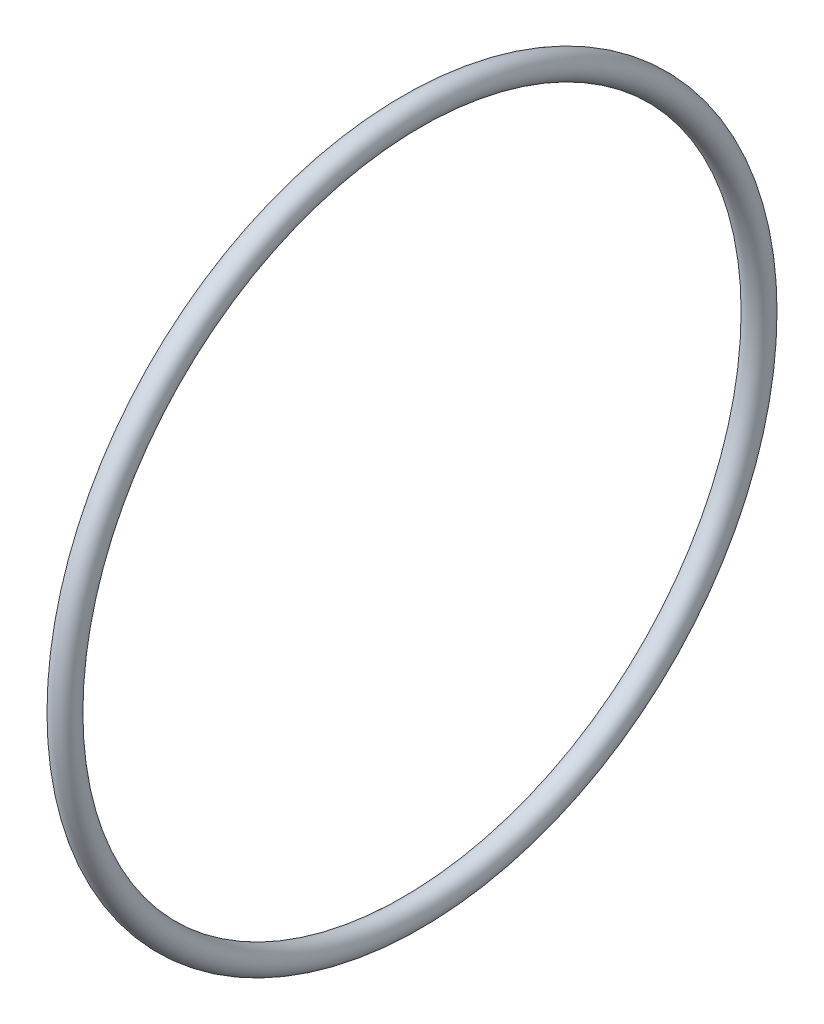
ISO-10303-21;
HEADER;
FILE_DESCRIPTION(('STEP AP214'),'2;1');
FILE_NAME('part.step','',(''),(''),'','','');
FILE_SCHEMA(('AUTOMOTIVE_DESIGN { 1 0 10303 214 1 1 1 1 }'));
ENDSEC;
DATA;
#1=APPLICATION_CONTEXT('core data for automotive mechanical design processes');
#2=APPLICATION_PROTOCOL_DEFINITION('international standard','automotive_design',2000,#1);
#3=PRODUCT_CONTEXT('',#1,'mechanical');
#4=PRODUCT('Part','Part','',(#3));
#5=PRODUCT_RELATED_PRODUCT_CATEGORY('part','',(#4));
#6=PRODUCT_DEFINITION_FORMATION('','',#4);
#7=PRODUCT_DEFINITION_CONTEXT('part definition',#1,'design');
#8=PRODUCT_DEFINITION('design','',#6,#7);
#9=PRODUCT_DEFINITION_SHAPE('','',#8);
#10=(LENGTH_UNIT() NAMED_UNIT(*) SI_UNIT(.MILLI.,.METRE.));
#11=(NAMED_UNIT(*) PLANE_ANGLE_UNIT() SI_UNIT($,.RADIAN.));
#12=(NAMED_UNIT(*) SI_UNIT($,.STERADIAN.) SOLID_ANGLE_UNIT());
#13=UNCERTAINTY_MEASURE_WITH_UNIT(LENGTH_MEASURE(1.E-05),#10,'distance_accuracy_value','');
#14=(GEOMETRIC_REPRESENTATION_CONTEXT(3) GLOBAL_UNCERTAINTY_ASSIGNED_CONTEXT((#13)) GLOBAL_UNIT_ASSIGNED_CONTEXT((#10,
#11,#12)) REPRESENTATION_CONTEXT('',''));
#15=CARTESIAN_POINT('',(0.,0.,0.));
#16=DIRECTION('',(0.,0.,1.));
#17=DIRECTION('',(1.,0.,0.));
#18=AXIS2_PLACEMENT_3D('',#15,#16,#17);
#19=CARTESIAN_POINT('',(26.889800043,0.,0.));
#20=DIRECTION('',(-1.,0.,0.));
#21=DIRECTION('',(0.,0.,1.));
#22=AXIS2_PLACEMENT_3D('',#19,#20,#21);
#23=TOROIDAL_SURFACE('',#22,25.950000043,0.950000004999999);
#24=CARTESIAN_POINT('',(26.889800043,0.,26.900000048));
#25=VERTEX_POINT('',#24);
#26=VERTEX_LOOP('',#25);
#27=FACE_BOUND('',#26,.T.);
#28=ADVANCED_FACE('F33',(#27),#23,.T.);
#29=CLOSED_SHELL('',(#28));
#30=MANIFOLD_SOLID_BREP('B2',#29);
#31=ADVANCED_BREP_SHAPE_REPRESENTATION('',(#18,#30),#14);
#32=SHAPE_DEFINITION_REPRESENTATION(#9,#31);
ENDSEC;
END-ISO-10303-21;
